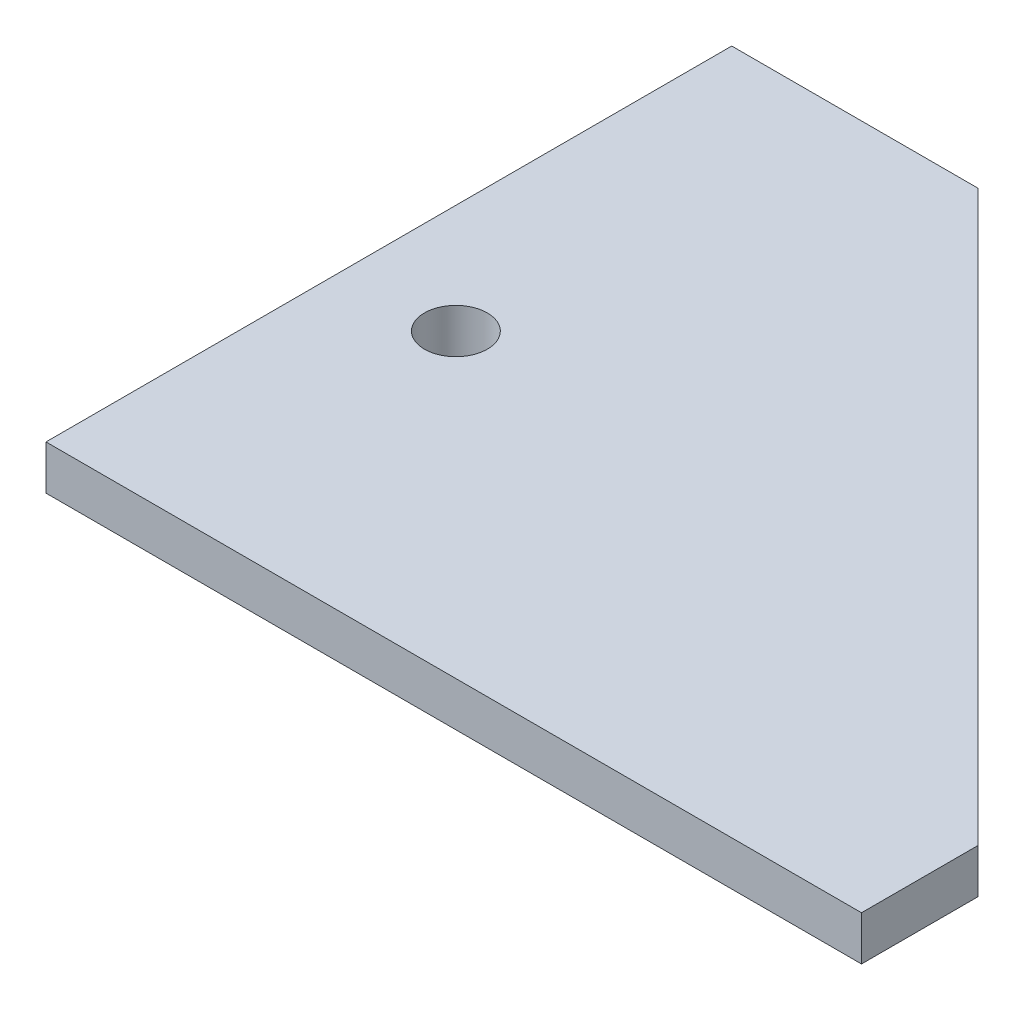
ISO-10303-21;
HEADER;
FILE_DESCRIPTION(('STEP AP214'),'2;1');
FILE_NAME('part.step','',(''),(''),'','','');
FILE_SCHEMA(('AUTOMOTIVE_DESIGN { 1 0 10303 214 1 1 1 1 }'));
ENDSEC;
DATA;
#1=APPLICATION_CONTEXT('core data for automotive mechanical design processes');
#2=APPLICATION_PROTOCOL_DEFINITION('international standard','automotive_design',2000,#1);
#3=PRODUCT_CONTEXT('',#1,'mechanical');
#4=PRODUCT('Part','Part','',(#3));
#5=PRODUCT_RELATED_PRODUCT_CATEGORY('part','',(#4));
#6=PRODUCT_DEFINITION_FORMATION('','',#4);
#7=PRODUCT_DEFINITION_CONTEXT('part definition',#1,'design');
#8=PRODUCT_DEFINITION('design','',#6,#7);
#9=PRODUCT_DEFINITION_SHAPE('','',#8);
#10=(LENGTH_UNIT() NAMED_UNIT(*) SI_UNIT(.MILLI.,.METRE.));
#11=(NAMED_UNIT(*) PLANE_ANGLE_UNIT() SI_UNIT($,.RADIAN.));
#12=(NAMED_UNIT(*) SI_UNIT($,.STERADIAN.) SOLID_ANGLE_UNIT());
#13=UNCERTAINTY_MEASURE_WITH_UNIT(LENGTH_MEASURE(1.E-05),#10,'distance_accuracy_value','');
#14=(GEOMETRIC_REPRESENTATION_CONTEXT(3) GLOBAL_UNCERTAINTY_ASSIGNED_CONTEXT((#13)) GLOBAL_UNIT_ASSIGNED_CONTEXT((#10,
#11,#12)) REPRESENTATION_CONTEXT('',''));
#15=CARTESIAN_POINT('',(0.,0.,0.));
#16=DIRECTION('',(0.,0.,1.));
#17=DIRECTION('',(1.,0.,0.));
#18=AXIS2_PLACEMENT_3D('',#15,#16,#17);
#19=CARTESIAN_POINT('',(350.,38.1,194.305));
#20=DIRECTION('',(-1.,0.,0.));
#21=DIRECTION('',(0.,0.,1.));
#22=AXIS2_PLACEMENT_3D('',#19,#20,#21);
#23=PLANE('',#22);
#24=DIRECTION('',(0.,0.,-1.));
#25=VECTOR('',#24,1.);
#26=CARTESIAN_POINT('',(350.,0.,194.305));
#27=LINE('',#26,#25);
#28=CARTESIAN_POINT('',(350.,0.,294.305));
#29=VERTEX_POINT('',#28);
#30=CARTESIAN_POINT('',(350.,0.,194.305));
#31=VERTEX_POINT('',#30);
#32=EDGE_CURVE('E107',#29,#31,#27,.T.);
#33=ORIENTED_EDGE('',*,*,#32,.T.);
#34=DIRECTION('',(0.,-1.,0.));
#35=VECTOR('',#34,1.);
#36=CARTESIAN_POINT('',(350.,38.1,194.305));
#37=LINE('',#36,#35);
#38=CARTESIAN_POINT('',(350.,38.1,194.305));
#39=VERTEX_POINT('',#38);
#40=EDGE_CURVE('E11',#39,#31,#37,.T.);
#41=ORIENTED_EDGE('',*,*,#40,.F.);
#42=DIRECTION('',(0.,0.,-1.));
#43=VECTOR('',#42,1.);
#44=CARTESIAN_POINT('',(350.,38.1,194.305));
#45=LINE('',#44,#43);
#46=CARTESIAN_POINT('',(350.,38.1,294.305));
#47=VERTEX_POINT('',#46);
#48=EDGE_CURVE('E116',#47,#39,#45,.T.);
#49=ORIENTED_EDGE('',*,*,#48,.F.);
#50=DIRECTION('',(0.,-1.,0.));
#51=VECTOR('',#50,1.);
#52=CARTESIAN_POINT('',(350.,38.1,294.305));
#53=LINE('',#52,#51);
#54=EDGE_CURVE('E103',#47,#29,#53,.T.);
#55=ORIENTED_EDGE('',*,*,#54,.T.);
#56=EDGE_LOOP('',(#33,#41,#49,#55));
#57=FACE_BOUND('',#56,.T.);
#58=ADVANCED_FACE('F33',(#57),#23,.F.);
#59=CARTESIAN_POINT('',(-138.609999999998,38.1,-294.305));
#60=DIRECTION('',(-0.707106781186549,0.,0.707106781186546));
#61=DIRECTION('',(0.707106781186546,0.,0.707106781186549));
#62=AXIS2_PLACEMENT_3D('',#59,#60,#61);
#63=PLANE('',#62);
#64=DIRECTION('',(-0.707106781186546,0.,-0.707106781186549));
#65=VECTOR('',#64,1.);
#66=CARTESIAN_POINT('',(-138.609999999998,0.,-294.305));
#67=LINE('',#66,#65);
#68=CARTESIAN_POINT('',(-138.609999999998,0.,-294.305));
#69=VERTEX_POINT('',#68);
#70=EDGE_CURVE('E110',#31,#69,#67,.T.);
#71=ORIENTED_EDGE('',*,*,#70,.T.);
#72=DIRECTION('',(0.,-1.,0.));
#73=VECTOR('',#72,1.);
#74=CARTESIAN_POINT('',(-138.609999999998,38.1,-294.305));
#75=LINE('',#74,#73);
#76=CARTESIAN_POINT('',(-138.609999999998,38.1,-294.305));
#77=VERTEX_POINT('',#76);
#78=EDGE_CURVE('E41',#77,#69,#75,.T.);
#79=ORIENTED_EDGE('',*,*,#78,.F.);
#80=DIRECTION('',(-0.707106781186546,0.,-0.707106781186549));
#81=VECTOR('',#80,1.);
#82=CARTESIAN_POINT('',(-138.609999999998,38.1,-294.305));
#83=LINE('',#82,#81);
#84=EDGE_CURVE('E83',#39,#77,#83,.T.);
#85=ORIENTED_EDGE('',*,*,#84,.F.);
#86=ORIENTED_EDGE('',*,*,#40,.T.);
#87=EDGE_LOOP('',(#71,#79,#85,#86));
#88=FACE_BOUND('',#87,.T.);
#89=ADVANCED_FACE('F136',(#88),#63,.F.);
#90=CARTESIAN_POINT('',(-350.,38.1,-294.305));
#91=DIRECTION('',(0.,0.,1.));
#92=DIRECTION('',(1.,0.,0.));
#93=AXIS2_PLACEMENT_3D('',#90,#91,#92);
#94=PLANE('',#93);
#95=DIRECTION('',(-1.,0.,0.));
#96=VECTOR('',#95,1.);
#97=CARTESIAN_POINT('',(-350.,0.,-294.305));
#98=LINE('',#97,#96);
#99=CARTESIAN_POINT('',(-350.,0.,-294.305));
#100=VERTEX_POINT('',#99);
#101=EDGE_CURVE('E98',#69,#100,#98,.T.);
#102=ORIENTED_EDGE('',*,*,#101,.T.);
#103=DIRECTION('',(0.,-1.,0.));
#104=VECTOR('',#103,1.);
#105=CARTESIAN_POINT('',(-350.,38.1,-294.305));
#106=LINE('',#105,#104);
#107=CARTESIAN_POINT('',(-350.,38.1,-294.305));
#108=VERTEX_POINT('',#107);
#109=EDGE_CURVE('E95',#108,#100,#106,.T.);
#110=ORIENTED_EDGE('',*,*,#109,.F.);
#111=DIRECTION('',(-1.,0.,0.));
#112=VECTOR('',#111,1.);
#113=CARTESIAN_POINT('',(-350.,38.1,-294.305));
#114=LINE('',#113,#112);
#115=EDGE_CURVE('E87',#77,#108,#114,.T.);
#116=ORIENTED_EDGE('',*,*,#115,.F.);
#117=ORIENTED_EDGE('',*,*,#78,.T.);
#118=EDGE_LOOP('',(#102,#110,#116,#117));
#119=FACE_BOUND('',#118,.T.);
#120=ADVANCED_FACE('F96',(#119),#94,.F.);
#121=CARTESIAN_POINT('',(-350.,38.1,-294.305));
#122=DIRECTION('',(1.,0.,0.));
#123=DIRECTION('',(0.,0.,-1.));
#124=AXIS2_PLACEMENT_3D('',#121,#122,#123);
#125=PLANE('',#124);
#126=DIRECTION('',(0.,0.,1.));
#127=VECTOR('',#126,1.);
#128=CARTESIAN_POINT('',(-350.,0.,-294.305));
#129=LINE('',#128,#127);
#130=CARTESIAN_POINT('',(-350.,0.,294.305));
#131=VERTEX_POINT('',#130);
#132=EDGE_CURVE('E69',#100,#131,#129,.T.);
#133=ORIENTED_EDGE('',*,*,#132,.T.);
#134=DIRECTION('',(0.,-1.,0.));
#135=VECTOR('',#134,1.);
#136=CARTESIAN_POINT('',(-350.,38.1,294.305));
#137=LINE('',#136,#135);
#138=CARTESIAN_POINT('',(-350.,38.1,294.305));
#139=VERTEX_POINT('',#138);
#140=EDGE_CURVE('E99',#139,#131,#137,.T.);
#141=ORIENTED_EDGE('',*,*,#140,.F.);
#142=DIRECTION('',(0.,0.,1.));
#143=VECTOR('',#142,1.);
#144=CARTESIAN_POINT('',(-350.,38.1,-294.305));
#145=LINE('',#144,#143);
#146=EDGE_CURVE('E91',#108,#139,#145,.T.);
#147=ORIENTED_EDGE('',*,*,#146,.F.);
#148=ORIENTED_EDGE('',*,*,#109,.T.);
#149=EDGE_LOOP('',(#133,#141,#147,#148));
#150=FACE_BOUND('',#149,.T.);
#151=ADVANCED_FACE('F101',(#150),#125,.F.);
#152=CARTESIAN_POINT('',(-350.,38.1,294.305));
#153=DIRECTION('',(0.,0.,-1.));
#154=DIRECTION('',(-1.,0.,0.));
#155=AXIS2_PLACEMENT_3D('',#152,#153,#154);
#156=PLANE('',#155);
#157=DIRECTION('',(1.,0.,0.));
#158=VECTOR('',#157,1.);
#159=CARTESIAN_POINT('',(-350.,0.,294.305));
#160=LINE('',#159,#158);
#161=EDGE_CURVE('E75',#131,#29,#160,.T.);
#162=ORIENTED_EDGE('',*,*,#161,.T.);
#163=ORIENTED_EDGE('',*,*,#54,.F.);
#164=DIRECTION('',(1.,0.,0.));
#165=VECTOR('',#164,1.);
#166=CARTESIAN_POINT('',(-350.,38.1,294.305));
#167=LINE('',#166,#165);
#168=EDGE_CURVE('E49',#139,#47,#167,.T.);
#169=ORIENTED_EDGE('',*,*,#168,.F.);
#170=ORIENTED_EDGE('',*,*,#140,.T.);
#171=EDGE_LOOP('',(#162,#163,#169,#170));
#172=FACE_BOUND('',#171,.T.);
#173=ADVANCED_FACE('F124',(#172),#156,.F.);
#174=CARTESIAN_POINT('',(0.,38.1,0.));
#175=DIRECTION('',(0.,1.,0.));
#176=DIRECTION('',(0.,0.,1.));
#177=AXIS2_PLACEMENT_3D('',#174,#175,#176);
#178=PLANE('',#177);
#179=CARTESIAN_POINT('',(-256.500204402315,38.1,35.9805031115005));
#180=DIRECTION('',(0.,-1.,0.));
#181=DIRECTION('',(0.,0.,-1.));
#182=AXIS2_PLACEMENT_3D('',#179,#180,#181);
#183=CIRCLE('',#182,26.9999999999999);
#184=CARTESIAN_POINT('',(-256.500204402315,38.1,8.98050311150052));
#185=VERTEX_POINT('',#184);
#186=EDGE_CURVE('E111',#185,#185,#183,.T.);
#187=ORIENTED_EDGE('',*,*,#186,.T.);
#188=EDGE_LOOP('',(#187));
#189=FACE_BOUND('',#188,.T.);
#190=ORIENTED_EDGE('',*,*,#48,.T.);
#191=ORIENTED_EDGE('',*,*,#84,.T.);
#192=ORIENTED_EDGE('',*,*,#115,.T.);
#193=ORIENTED_EDGE('',*,*,#146,.T.);
#194=ORIENTED_EDGE('',*,*,#168,.T.);
#195=EDGE_LOOP('',(#190,#191,#192,#193,#194));
#196=FACE_BOUND('',#195,.T.);
#197=ADVANCED_FACE('F89',(#189,#196),#178,.T.);
#198=CARTESIAN_POINT('',(0.,0.,0.));
#199=DIRECTION('',(0.,1.,0.));
#200=DIRECTION('',(0.,0.,1.));
#201=AXIS2_PLACEMENT_3D('',#198,#199,#200);
#202=PLANE('',#201);
#203=CARTESIAN_POINT('',(-256.500204402315,0.,35.9805031115005));
#204=DIRECTION('',(0.,-1.,0.));
#205=DIRECTION('',(0.,0.,-1.));
#206=AXIS2_PLACEMENT_3D('',#203,#204,#205);
#207=CIRCLE('',#206,26.9999999999999);
#208=CARTESIAN_POINT('',(-256.500204402315,0.,8.98050311150052));
#209=VERTEX_POINT('',#208);
#210=EDGE_CURVE('E187',#209,#209,#207,.T.);
#211=ORIENTED_EDGE('',*,*,#210,.F.);
#212=EDGE_LOOP('',(#211));
#213=FACE_BOUND('',#212,.T.);
#214=ORIENTED_EDGE('',*,*,#32,.F.);
#215=ORIENTED_EDGE('',*,*,#161,.F.);
#216=ORIENTED_EDGE('',*,*,#132,.F.);
#217=ORIENTED_EDGE('',*,*,#101,.F.);
#218=ORIENTED_EDGE('',*,*,#70,.F.);
#219=EDGE_LOOP('',(#214,#215,#216,#217,#218));
#220=FACE_BOUND('',#219,.T.);
#221=ADVANCED_FACE('F120',(#213,#220),#202,.F.);
#222=CARTESIAN_POINT('',(-256.500204402315,38.1,35.9805031115005));
#223=DIRECTION('',(0.,-1.,0.));
#224=DIRECTION('',(0.,0.,-1.));
#225=AXIS2_PLACEMENT_3D('',#222,#223,#224);
#226=CYLINDRICAL_SURFACE('',#225,26.9999999999999);
#227=ORIENTED_EDGE('',*,*,#186,.F.);
#228=EDGE_LOOP('',(#227));
#229=FACE_BOUND('',#228,.T.);
#230=ORIENTED_EDGE('',*,*,#210,.T.);
#231=EDGE_LOOP('',(#230));
#232=FACE_BOUND('',#231,.T.);
#233=ADVANCED_FACE('F169',(#229,#232),#226,.F.);
#234=CLOSED_SHELL('',(#58,#89,#120,#151,#173,#197,#221,#233));
#235=MANIFOLD_SOLID_BREP('B2',#234);
#236=ADVANCED_BREP_SHAPE_REPRESENTATION('',(#18,#235),#14);
#237=SHAPE_DEFINITION_REPRESENTATION(#9,#236);
ENDSEC;
END-ISO-10303-21;
